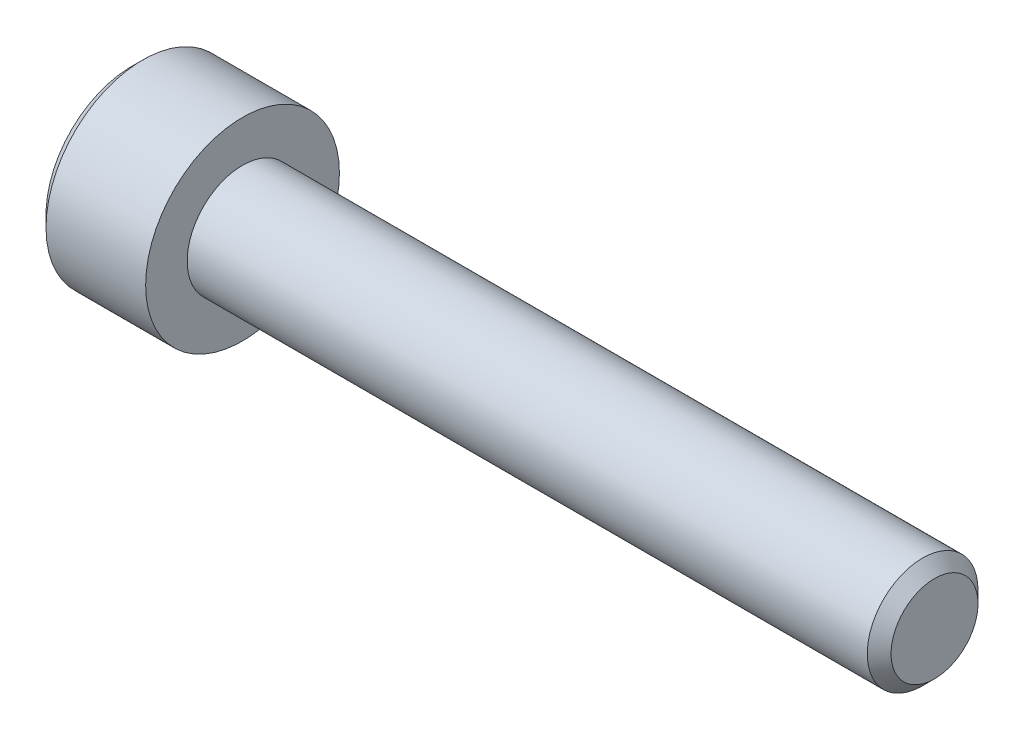
ISO-10303-21;
HEADER;
FILE_DESCRIPTION(('STEP AP214'),'2;1');
FILE_NAME('part.step','',(''),(''),'','','');
FILE_SCHEMA(('AUTOMOTIVE_DESIGN { 1 0 10303 214 1 1 1 1 }'));
ENDSEC;
DATA;
#1=APPLICATION_CONTEXT('core data for automotive mechanical design processes');
#2=APPLICATION_PROTOCOL_DEFINITION('international standard','automotive_design',2000,#1);
#3=PRODUCT_CONTEXT('',#1,'mechanical');
#4=PRODUCT('Part','Part','',(#3));
#5=PRODUCT_RELATED_PRODUCT_CATEGORY('part','',(#4));
#6=PRODUCT_DEFINITION_FORMATION('','',#4);
#7=PRODUCT_DEFINITION_CONTEXT('part definition',#1,'design');
#8=PRODUCT_DEFINITION('design','',#6,#7);
#9=PRODUCT_DEFINITION_SHAPE('','',#8);
#10=(LENGTH_UNIT() NAMED_UNIT(*) SI_UNIT(.MILLI.,.METRE.));
#11=(NAMED_UNIT(*) PLANE_ANGLE_UNIT() SI_UNIT($,.RADIAN.));
#12=(NAMED_UNIT(*) SI_UNIT($,.STERADIAN.) SOLID_ANGLE_UNIT());
#13=UNCERTAINTY_MEASURE_WITH_UNIT(LENGTH_MEASURE(1.E-05),#10,'distance_accuracy_value','');
#14=(GEOMETRIC_REPRESENTATION_CONTEXT(3) GLOBAL_UNCERTAINTY_ASSIGNED_CONTEXT((#13)) GLOBAL_UNIT_ASSIGNED_CONTEXT((#10,
#11,#12)) REPRESENTATION_CONTEXT('',''));
#15=CARTESIAN_POINT('',(0.,0.,0.));
#16=DIRECTION('',(0.,0.,1.));
#17=DIRECTION('',(1.,0.,0.));
#18=AXIS2_PLACEMENT_3D('',#15,#16,#17);
#19=CARTESIAN_POINT('',(-2.,0.,0.));
#20=DIRECTION('',(-1.,0.,0.));
#21=DIRECTION('',(0.,0.,1.));
#22=AXIS2_PLACEMENT_3D('',#19,#20,#21);
#23=CONICAL_SURFACE('',#22,1.5,1.30899693899575);
#24=CARTESIAN_POINT('',(-2.,0.,0.));
#25=DIRECTION('',(1.,0.,0.));
#26=DIRECTION('',(0.,0.,-1.));
#27=AXIS2_PLACEMENT_3D('',#24,#25,#26);
#28=CIRCLE('',#27,1.5);
#29=CARTESIAN_POINT('',(-2.,1.29903810567666,-0.75));
#30=VERTEX_POINT('',#29);
#31=CARTESIAN_POINT('',(-2.,1.29903810567666,0.75));
#32=VERTEX_POINT('',#31);
#33=EDGE_CURVE('E103',#30,#32,#28,.T.);
#34=ORIENTED_EDGE('',*,*,#33,.F.);
#35=CARTESIAN_POINT('',(-2.,0.,0.));
#36=DIRECTION('',(1.,0.,0.));
#37=DIRECTION('',(0.,0.,-1.));
#38=AXIS2_PLACEMENT_3D('',#35,#36,#37);
#39=CIRCLE('',#38,1.5);
#40=CARTESIAN_POINT('',(-2.,0.,-1.5));
#41=VERTEX_POINT('',#40);
#42=EDGE_CURVE('E106',#41,#30,#39,.T.);
#43=ORIENTED_EDGE('',*,*,#42,.F.);
#44=CARTESIAN_POINT('',(-2.,0.,0.));
#45=DIRECTION('',(1.,0.,0.));
#46=DIRECTION('',(0.,0.,-1.));
#47=AXIS2_PLACEMENT_3D('',#44,#45,#46);
#48=CIRCLE('',#47,1.5);
#49=CARTESIAN_POINT('',(-2.,-1.29903810567666,-0.75));
#50=VERTEX_POINT('',#49);
#51=EDGE_CURVE('E11',#50,#41,#48,.T.);
#52=ORIENTED_EDGE('',*,*,#51,.F.);
#53=CARTESIAN_POINT('',(-2.,0.,0.));
#54=DIRECTION('',(1.,0.,0.));
#55=DIRECTION('',(0.,0.,-1.));
#56=AXIS2_PLACEMENT_3D('',#53,#54,#55);
#57=CIRCLE('',#56,1.5);
#58=CARTESIAN_POINT('',(-2.,-1.29903810567666,0.75));
#59=VERTEX_POINT('',#58);
#60=EDGE_CURVE('E26',#59,#50,#57,.T.);
#61=ORIENTED_EDGE('',*,*,#60,.F.);
#62=CARTESIAN_POINT('',(-2.,0.,0.));
#63=DIRECTION('',(1.,0.,0.));
#64=DIRECTION('',(0.,0.,-1.));
#65=AXIS2_PLACEMENT_3D('',#62,#63,#64);
#66=CIRCLE('',#65,1.5);
#67=CARTESIAN_POINT('',(-2.,0.,1.5));
#68=VERTEX_POINT('',#67);
#69=EDGE_CURVE('E183',#68,#59,#66,.T.);
#70=ORIENTED_EDGE('',*,*,#69,.F.);
#71=CARTESIAN_POINT('',(-2.,0.,0.));
#72=DIRECTION('',(1.,0.,0.));
#73=DIRECTION('',(0.,0.,-1.));
#74=AXIS2_PLACEMENT_3D('',#71,#72,#73);
#75=CIRCLE('',#74,1.5);
#76=EDGE_CURVE('E39',#32,#68,#75,.T.);
#77=ORIENTED_EDGE('',*,*,#76,.F.);
#78=EDGE_LOOP('',(#34,#43,#52,#61,#70,#77));
#79=FACE_BOUND('',#78,.T.);
#80=CARTESIAN_POINT('',(-1.59807621135332,0.,0.));
#81=VERTEX_POINT('',#80);
#82=VERTEX_LOOP('',#81);
#83=FACE_BOUND('',#82,.T.);
#84=ADVANCED_FACE('F17',(#79,#83),#23,.F.);
#85=CARTESIAN_POINT('',(-2.,0.,0.));
#86=DIRECTION('',(1.,0.,0.));
#87=DIRECTION('',(0.,1.,0.));
#88=AXIS2_PLACEMENT_3D('',#85,#86,#87);
#89=PLANE('',#88);
#90=ORIENTED_EDGE('',*,*,#51,.T.);
#91=DIRECTION('',(0.,1.,0.));
#92=VECTOR('',#91,1.);
#93=CARTESIAN_POINT('',(-2.,-0.866025403784439,-1.5));
#94=LINE('',#93,#92);
#95=CARTESIAN_POINT('',(-2.,-0.866025403784439,-1.5));
#96=VERTEX_POINT('',#95);
#97=EDGE_CURVE('E172',#96,#41,#94,.T.);
#98=ORIENTED_EDGE('',*,*,#97,.F.);
#99=DIRECTION('',(0.,0.5,-0.866025403784439));
#100=VECTOR('',#99,1.);
#101=CARTESIAN_POINT('',(-2.,-1.73205080756888,0.));
#102=LINE('',#101,#100);
#103=EDGE_CURVE('E162',#50,#96,#102,.T.);
#104=ORIENTED_EDGE('',*,*,#103,.F.);
#105=EDGE_LOOP('',(#90,#98,#104));
#106=FACE_BOUND('',#105,.T.);
#107=ADVANCED_FACE('F198',(#106),#89,.F.);
#108=CARTESIAN_POINT('',(-2.,0.,0.));
#109=DIRECTION('',(1.,0.,0.));
#110=DIRECTION('',(0.,1.,0.));
#111=AXIS2_PLACEMENT_3D('',#108,#109,#110);
#112=PLANE('',#111);
#113=ORIENTED_EDGE('',*,*,#60,.T.);
#114=DIRECTION('',(0.,0.5,-0.866025403784439));
#115=VECTOR('',#114,1.);
#116=CARTESIAN_POINT('',(-2.,-1.73205080756888,0.));
#117=LINE('',#116,#115);
#118=CARTESIAN_POINT('',(-2.,-1.73205080756888,0.));
#119=VERTEX_POINT('',#118);
#120=EDGE_CURVE('E158',#119,#50,#117,.T.);
#121=ORIENTED_EDGE('',*,*,#120,.F.);
#122=DIRECTION('',(0.,-0.5,-0.866025403784439));
#123=VECTOR('',#122,1.);
#124=CARTESIAN_POINT('',(-2.,-0.866025403784439,1.5));
#125=LINE('',#124,#123);
#126=EDGE_CURVE('E150',#59,#119,#125,.T.);
#127=ORIENTED_EDGE('',*,*,#126,.F.);
#128=EDGE_LOOP('',(#113,#121,#127));
#129=FACE_BOUND('',#128,.T.);
#130=ADVANCED_FACE('F194',(#129),#112,.F.);
#131=CARTESIAN_POINT('',(-2.,0.,0.));
#132=DIRECTION('',(1.,0.,0.));
#133=DIRECTION('',(0.,1.,0.));
#134=AXIS2_PLACEMENT_3D('',#131,#132,#133);
#135=PLANE('',#134);
#136=ORIENTED_EDGE('',*,*,#69,.T.);
#137=DIRECTION('',(0.,-0.5,-0.866025403784439));
#138=VECTOR('',#137,1.);
#139=CARTESIAN_POINT('',(-2.,-0.866025403784439,1.5));
#140=LINE('',#139,#138);
#141=CARTESIAN_POINT('',(-2.,-0.866025403784439,1.5));
#142=VERTEX_POINT('',#141);
#143=EDGE_CURVE('E148',#142,#59,#140,.T.);
#144=ORIENTED_EDGE('',*,*,#143,.F.);
#145=DIRECTION('',(0.,-1.,0.));
#146=VECTOR('',#145,1.);
#147=CARTESIAN_POINT('',(-2.,0.866025403784439,1.5));
#148=LINE('',#147,#146);
#149=EDGE_CURVE('E220',#68,#142,#148,.T.);
#150=ORIENTED_EDGE('',*,*,#149,.F.);
#151=EDGE_LOOP('',(#136,#144,#150));
#152=FACE_BOUND('',#151,.T.);
#153=ADVANCED_FACE('F305',(#152),#135,.F.);
#154=CARTESIAN_POINT('',(-2.,0.,0.));
#155=DIRECTION('',(1.,0.,0.));
#156=DIRECTION('',(0.,1.,0.));
#157=AXIS2_PLACEMENT_3D('',#154,#155,#156);
#158=PLANE('',#157);
#159=ORIENTED_EDGE('',*,*,#76,.T.);
#160=DIRECTION('',(0.,-1.,0.));
#161=VECTOR('',#160,1.);
#162=CARTESIAN_POINT('',(-2.,0.866025403784439,1.5));
#163=LINE('',#162,#161);
#164=CARTESIAN_POINT('',(-2.,0.866025403784439,1.5));
#165=VERTEX_POINT('',#164);
#166=EDGE_CURVE('E226',#165,#68,#163,.T.);
#167=ORIENTED_EDGE('',*,*,#166,.F.);
#168=DIRECTION('',(0.,-0.5,0.866025403784439));
#169=VECTOR('',#168,1.);
#170=CARTESIAN_POINT('',(-2.,1.73205080756888,0.));
#171=LINE('',#170,#169);
#172=EDGE_CURVE('E122',#32,#165,#171,.T.);
#173=ORIENTED_EDGE('',*,*,#172,.F.);
#174=EDGE_LOOP('',(#159,#167,#173));
#175=FACE_BOUND('',#174,.T.);
#176=ADVANCED_FACE('F310',(#175),#158,.F.);
#177=CARTESIAN_POINT('',(-2.,0.,0.));
#178=DIRECTION('',(1.,0.,0.));
#179=DIRECTION('',(0.,1.,0.));
#180=AXIS2_PLACEMENT_3D('',#177,#178,#179);
#181=PLANE('',#180);
#182=DIRECTION('',(0.,0.5,0.866025403784439));
#183=VECTOR('',#182,1.);
#184=CARTESIAN_POINT('',(-2.,0.866025403784439,-1.5));
#185=LINE('',#184,#183);
#186=CARTESIAN_POINT('',(-2.,1.73205080756888,0.));
#187=VERTEX_POINT('',#186);
#188=EDGE_CURVE('E125',#30,#187,#185,.T.);
#189=ORIENTED_EDGE('',*,*,#188,.F.);
#190=ORIENTED_EDGE('',*,*,#33,.T.);
#191=DIRECTION('',(0.,-0.5,0.866025403784439));
#192=VECTOR('',#191,1.);
#193=CARTESIAN_POINT('',(-2.,1.73205080756888,0.));
#194=LINE('',#193,#192);
#195=EDGE_CURVE('E128',#187,#32,#194,.T.);
#196=ORIENTED_EDGE('',*,*,#195,.F.);
#197=EDGE_LOOP('',(#189,#190,#196));
#198=FACE_BOUND('',#197,.T.);
#199=ADVANCED_FACE('F126',(#198),#181,.F.);
#200=CARTESIAN_POINT('',(-2.,0.,0.));
#201=DIRECTION('',(1.,0.,0.));
#202=DIRECTION('',(0.,1.,0.));
#203=AXIS2_PLACEMENT_3D('',#200,#201,#202);
#204=PLANE('',#203);
#205=ORIENTED_EDGE('',*,*,#42,.T.);
#206=DIRECTION('',(0.,0.5,0.866025403784439));
#207=VECTOR('',#206,1.);
#208=CARTESIAN_POINT('',(-2.,0.866025403784439,-1.5));
#209=LINE('',#208,#207);
#210=CARTESIAN_POINT('',(-2.,0.866025403784438,-1.5));
#211=VERTEX_POINT('',#210);
#212=EDGE_CURVE('E116',#211,#30,#209,.T.);
#213=ORIENTED_EDGE('',*,*,#212,.F.);
#214=DIRECTION('',(0.,1.,0.));
#215=VECTOR('',#214,1.);
#216=CARTESIAN_POINT('',(-2.,-0.866025403784439,-1.5));
#217=LINE('',#216,#215);
#218=EDGE_CURVE('E119',#41,#211,#217,.T.);
#219=ORIENTED_EDGE('',*,*,#218,.F.);
#220=EDGE_LOOP('',(#205,#213,#219));
#221=FACE_BOUND('',#220,.T.);
#222=ADVANCED_FACE('F114',(#221),#204,.F.);
#223=CARTESIAN_POINT('',(-2.,1.73205080756888,0.));
#224=DIRECTION('',(0.,-0.866025403784439,-0.5));
#225=DIRECTION('',(0.,0.5,-0.866025403784439));
#226=AXIS2_PLACEMENT_3D('',#223,#224,#225);
#227=PLANE('',#226);
#228=DIRECTION('',(0.,-0.5,0.866025403784439));
#229=VECTOR('',#228,1.);
#230=CARTESIAN_POINT('',(-4.,1.73205080756888,0.));
#231=LINE('',#230,#229);
#232=CARTESIAN_POINT('',(-4.,1.73205080756888,0.));
#233=VERTEX_POINT('',#232);
#234=CARTESIAN_POINT('',(-4.,0.866025403784439,1.5));
#235=VERTEX_POINT('',#234);
#236=EDGE_CURVE('E252',#233,#235,#231,.T.);
#237=ORIENTED_EDGE('',*,*,#236,.F.);
#238=DIRECTION('',(-1.,0.,0.));
#239=VECTOR('',#238,1.);
#240=CARTESIAN_POINT('',(-2.,1.73205080756888,0.));
#241=LINE('',#240,#239);
#242=EDGE_CURVE('E133',#187,#233,#241,.T.);
#243=ORIENTED_EDGE('',*,*,#242,.F.);
#244=ORIENTED_EDGE('',*,*,#195,.T.);
#245=ORIENTED_EDGE('',*,*,#172,.T.);
#246=DIRECTION('',(-1.,0.,0.));
#247=VECTOR('',#246,1.);
#248=CARTESIAN_POINT('',(-2.,0.866025403784439,1.5));
#249=LINE('',#248,#247);
#250=EDGE_CURVE('E232',#165,#235,#249,.T.);
#251=ORIENTED_EDGE('',*,*,#250,.T.);
#252=EDGE_LOOP('',(#237,#243,#244,#245,#251));
#253=FACE_BOUND('',#252,.T.);
#254=ADVANCED_FACE('F315',(#253),#227,.T.);
#255=CARTESIAN_POINT('',(-2.,0.866025403784439,-1.5));
#256=DIRECTION('',(0.,-0.866025403784439,0.5));
#257=DIRECTION('',(-1.,0.,0.));
#258=AXIS2_PLACEMENT_3D('',#255,#256,#257);
#259=PLANE('',#258);
#260=DIRECTION('',(0.,0.5,0.866025403784439));
#261=VECTOR('',#260,1.);
#262=CARTESIAN_POINT('',(-4.,0.866025403784439,-1.5));
#263=LINE('',#262,#261);
#264=CARTESIAN_POINT('',(-4.,0.866025403784438,-1.5));
#265=VERTEX_POINT('',#264);
#266=EDGE_CURVE('E258',#265,#233,#263,.T.);
#267=ORIENTED_EDGE('',*,*,#266,.F.);
#268=DIRECTION('',(-1.,0.,0.));
#269=VECTOR('',#268,1.);
#270=CARTESIAN_POINT('',(-2.,0.866025403784438,-1.5));
#271=LINE('',#270,#269);
#272=EDGE_CURVE('E138',#211,#265,#271,.T.);
#273=ORIENTED_EDGE('',*,*,#272,.F.);
#274=ORIENTED_EDGE('',*,*,#212,.T.);
#275=ORIENTED_EDGE('',*,*,#188,.T.);
#276=ORIENTED_EDGE('',*,*,#242,.T.);
#277=EDGE_LOOP('',(#267,#273,#274,#275,#276));
#278=FACE_BOUND('',#277,.T.);
#279=ADVANCED_FACE('F136',(#278),#259,.T.);
#280=CARTESIAN_POINT('',(-2.,-0.866025403784439,-1.5));
#281=DIRECTION('',(0.,0.,1.));
#282=DIRECTION('',(1.,0.,0.));
#283=AXIS2_PLACEMENT_3D('',#280,#281,#282);
#284=PLANE('',#283);
#285=DIRECTION('',(0.,1.,0.));
#286=VECTOR('',#285,1.);
#287=CARTESIAN_POINT('',(-4.,-0.866025403784439,-1.5));
#288=LINE('',#287,#286);
#289=CARTESIAN_POINT('',(-4.,-0.866025403784439,-1.5));
#290=VERTEX_POINT('',#289);
#291=EDGE_CURVE('E262',#290,#265,#288,.T.);
#292=ORIENTED_EDGE('',*,*,#291,.F.);
#293=DIRECTION('',(-1.,0.,0.));
#294=VECTOR('',#293,1.);
#295=CARTESIAN_POINT('',(-2.,-0.866025403784439,-1.5));
#296=LINE('',#295,#294);
#297=EDGE_CURVE('E166',#96,#290,#296,.T.);
#298=ORIENTED_EDGE('',*,*,#297,.F.);
#299=ORIENTED_EDGE('',*,*,#97,.T.);
#300=ORIENTED_EDGE('',*,*,#218,.T.);
#301=ORIENTED_EDGE('',*,*,#272,.T.);
#302=EDGE_LOOP('',(#292,#298,#299,#300,#301));
#303=FACE_BOUND('',#302,.T.);
#304=ADVANCED_FACE('F321',(#303),#284,.T.);
#305=CARTESIAN_POINT('',(-2.,-1.73205080756888,0.));
#306=DIRECTION('',(0.,0.866025403784439,0.5));
#307=DIRECTION('',(1.,0.,0.));
#308=AXIS2_PLACEMENT_3D('',#305,#306,#307);
#309=PLANE('',#308);
#310=DIRECTION('',(0.,0.5,-0.866025403784439));
#311=VECTOR('',#310,1.);
#312=CARTESIAN_POINT('',(-4.,-1.73205080756888,0.));
#313=LINE('',#312,#311);
#314=CARTESIAN_POINT('',(-4.,-1.73205080756888,0.));
#315=VERTEX_POINT('',#314);
#316=EDGE_CURVE('E205',#315,#290,#313,.T.);
#317=ORIENTED_EDGE('',*,*,#316,.F.);
#318=DIRECTION('',(-1.,0.,0.));
#319=VECTOR('',#318,1.);
#320=CARTESIAN_POINT('',(-2.,-1.73205080756888,0.));
#321=LINE('',#320,#319);
#322=EDGE_CURVE('E153',#119,#315,#321,.T.);
#323=ORIENTED_EDGE('',*,*,#322,.F.);
#324=ORIENTED_EDGE('',*,*,#120,.T.);
#325=ORIENTED_EDGE('',*,*,#103,.T.);
#326=ORIENTED_EDGE('',*,*,#297,.T.);
#327=EDGE_LOOP('',(#317,#323,#324,#325,#326));
#328=FACE_BOUND('',#327,.T.);
#329=ADVANCED_FACE('F202',(#328),#309,.T.);
#330=CARTESIAN_POINT('',(-2.,-0.866025403784439,1.5));
#331=DIRECTION('',(0.,0.866025403784439,-0.5));
#332=DIRECTION('',(-1.,0.,0.));
#333=AXIS2_PLACEMENT_3D('',#330,#331,#332);
#334=PLANE('',#333);
#335=DIRECTION('',(0.,-0.5,-0.866025403784439));
#336=VECTOR('',#335,1.);
#337=CARTESIAN_POINT('',(-4.,-0.866025403784439,1.5));
#338=LINE('',#337,#336);
#339=CARTESIAN_POINT('',(-4.,-0.866025403784439,1.5));
#340=VERTEX_POINT('',#339);
#341=EDGE_CURVE('E245',#340,#315,#338,.T.);
#342=ORIENTED_EDGE('',*,*,#341,.F.);
#343=DIRECTION('',(-1.,0.,0.));
#344=VECTOR('',#343,1.);
#345=CARTESIAN_POINT('',(-2.,-0.866025403784439,1.5));
#346=LINE('',#345,#344);
#347=EDGE_CURVE('E211',#142,#340,#346,.T.);
#348=ORIENTED_EDGE('',*,*,#347,.F.);
#349=ORIENTED_EDGE('',*,*,#143,.T.);
#350=ORIENTED_EDGE('',*,*,#126,.T.);
#351=ORIENTED_EDGE('',*,*,#322,.T.);
#352=EDGE_LOOP('',(#342,#348,#349,#350,#351));
#353=FACE_BOUND('',#352,.T.);
#354=ADVANCED_FACE('F209',(#353),#334,.T.);
#355=CARTESIAN_POINT('',(-2.,0.866025403784439,1.5));
#356=DIRECTION('',(0.,0.,-1.));
#357=DIRECTION('',(0.,-1.,0.));
#358=AXIS2_PLACEMENT_3D('',#355,#356,#357);
#359=PLANE('',#358);
#360=DIRECTION('',(0.,-1.,0.));
#361=VECTOR('',#360,1.);
#362=CARTESIAN_POINT('',(-4.,0.866025403784439,1.5));
#363=LINE('',#362,#361);
#364=EDGE_CURVE('E248',#235,#340,#363,.T.);
#365=ORIENTED_EDGE('',*,*,#364,.F.);
#366=ORIENTED_EDGE('',*,*,#250,.F.);
#367=ORIENTED_EDGE('',*,*,#166,.T.);
#368=ORIENTED_EDGE('',*,*,#149,.T.);
#369=ORIENTED_EDGE('',*,*,#347,.T.);
#370=EDGE_LOOP('',(#365,#366,#367,#368,#369));
#371=FACE_BOUND('',#370,.T.);
#372=ADVANCED_FACE('F295',(#371),#359,.T.);
#373=CARTESIAN_POINT('',(25.,1.5705,0.));
#374=DIRECTION('',(-1.,0.,0.));
#375=DIRECTION('',(0.,0.,1.));
#376=AXIS2_PLACEMENT_3D('',#373,#374,#375);
#377=PLANE('',#376);
#378=CARTESIAN_POINT('',(25.,0.,0.));
#379=DIRECTION('',(1.,0.,0.));
#380=DIRECTION('',(0.,0.,-1.));
#381=AXIS2_PLACEMENT_3D('',#378,#379,#380);
#382=CIRCLE('',#381,1.5705);
#383=CARTESIAN_POINT('',(25.,0.,-1.5705));
#384=VERTEX_POINT('',#383);
#385=EDGE_CURVE('E235',#384,#384,#382,.T.);
#386=ORIENTED_EDGE('',*,*,#385,.T.);
#387=EDGE_LOOP('',(#386));
#388=FACE_BOUND('',#387,.T.);
#389=ADVANCED_FACE('F280',(#388),#377,.F.);
#390=CARTESIAN_POINT('',(24.5705,0.,0.));
#391=DIRECTION('',(-1.,0.,0.));
#392=DIRECTION('',(0.,0.,1.));
#393=AXIS2_PLACEMENT_3D('',#390,#391,#392);
#394=CONICAL_SURFACE('',#393,2.,0.785398163397445);
#395=CARTESIAN_POINT('',(24.5705,0.,0.));
#396=DIRECTION('',(1.,0.,0.));
#397=DIRECTION('',(0.,0.,-1.));
#398=AXIS2_PLACEMENT_3D('',#395,#396,#397);
#399=CIRCLE('',#398,2.);
#400=CARTESIAN_POINT('',(24.5705,0.,-2.));
#401=VERTEX_POINT('',#400);
#402=EDGE_CURVE('E238',#401,#401,#399,.T.);
#403=ORIENTED_EDGE('',*,*,#402,.T.);
#404=EDGE_LOOP('',(#403));
#405=FACE_BOUND('',#404,.T.);
#406=ORIENTED_EDGE('',*,*,#385,.F.);
#407=EDGE_LOOP('',(#406));
#408=FACE_BOUND('',#407,.T.);
#409=ADVANCED_FACE('F282',(#405,#408),#394,.T.);
#410=CARTESIAN_POINT('',(25.,0.,0.));
#411=DIRECTION('',(1.,0.,0.));
#412=DIRECTION('',(0.,0.,-1.));
#413=AXIS2_PLACEMENT_3D('',#410,#411,#412);
#414=CYLINDRICAL_SURFACE('',#413,2.);
#415=CARTESIAN_POINT('',(0.,0.,0.));
#416=DIRECTION('',(1.,0.,0.));
#417=DIRECTION('',(0.,0.,-1.));
#418=AXIS2_PLACEMENT_3D('',#415,#416,#417);
#419=CIRCLE('',#418,2.);
#420=CARTESIAN_POINT('',(0.,0.,-2.));
#421=VERTEX_POINT('',#420);
#422=EDGE_CURVE('E236',#421,#421,#419,.T.);
#423=ORIENTED_EDGE('',*,*,#422,.T.);
#424=EDGE_LOOP('',(#423));
#425=FACE_BOUND('',#424,.T.);
#426=ORIENTED_EDGE('',*,*,#402,.F.);
#427=EDGE_LOOP('',(#426));
#428=FACE_BOUND('',#427,.T.);
#429=ADVANCED_FACE('F284',(#425,#428),#414,.T.);
#430=CARTESIAN_POINT('',(0.,3.5,0.));
#431=DIRECTION('',(-1.,0.,0.));
#432=DIRECTION('',(0.,0.,1.));
#433=AXIS2_PLACEMENT_3D('',#430,#431,#432);
#434=PLANE('',#433);
#435=CARTESIAN_POINT('',(0.,0.,0.));
#436=DIRECTION('',(1.,0.,0.));
#437=DIRECTION('',(0.,0.,-1.));
#438=AXIS2_PLACEMENT_3D('',#435,#436,#437);
#439=CIRCLE('',#438,3.5);
#440=CARTESIAN_POINT('',(0.,0.,-3.5));
#441=VERTEX_POINT('',#440);
#442=EDGE_CURVE('E239',#441,#441,#439,.T.);
#443=ORIENTED_EDGE('',*,*,#442,.T.);
#444=EDGE_LOOP('',(#443));
#445=FACE_BOUND('',#444,.T.);
#446=ORIENTED_EDGE('',*,*,#422,.F.);
#447=EDGE_LOOP('',(#446));
#448=FACE_BOUND('',#447,.T.);
#449=ADVANCED_FACE('F292',(#445,#448),#434,.F.);
#450=CARTESIAN_POINT('',(25.,0.,0.));
#451=DIRECTION('',(1.,0.,0.));
#452=DIRECTION('',(0.,0.,-1.));
#453=AXIS2_PLACEMENT_3D('',#450,#451,#452);
#454=CYLINDRICAL_SURFACE('',#453,3.5);
#455=CARTESIAN_POINT('',(-3.6,0.,0.));
#456=DIRECTION('',(1.,0.,0.));
#457=DIRECTION('',(0.,0.,-1.));
#458=AXIS2_PLACEMENT_3D('',#455,#456,#457);
#459=CIRCLE('',#458,3.5);
#460=CARTESIAN_POINT('',(-3.6,0.,-3.5));
#461=VERTEX_POINT('',#460);
#462=EDGE_CURVE('E241',#461,#461,#459,.T.);
#463=ORIENTED_EDGE('',*,*,#462,.T.);
#464=EDGE_LOOP('',(#463));
#465=FACE_BOUND('',#464,.T.);
#466=ORIENTED_EDGE('',*,*,#442,.F.);
#467=EDGE_LOOP('',(#466));
#468=FACE_BOUND('',#467,.T.);
#469=ADVANCED_FACE('F337',(#465,#468),#454,.T.);
#470=CARTESIAN_POINT('',(-4.,0.,0.));
#471=DIRECTION('',(1.,0.,0.));
#472=DIRECTION('',(0.,0.,-1.));
#473=AXIS2_PLACEMENT_3D('',#470,#471,#472);
#474=CONICAL_SURFACE('',#473,3.1,0.785398163397447);
#475=CARTESIAN_POINT('',(-4.,0.,0.));
#476=DIRECTION('',(1.,0.,0.));
#477=DIRECTION('',(0.,0.,-1.));
#478=AXIS2_PLACEMENT_3D('',#475,#476,#477);
#479=CIRCLE('',#478,3.1);
#480=CARTESIAN_POINT('',(-4.,0.,-3.1));
#481=VERTEX_POINT('',#480);
#482=EDGE_CURVE('E268',#481,#481,#479,.T.);
#483=ORIENTED_EDGE('',*,*,#482,.T.);
#484=EDGE_LOOP('',(#483));
#485=FACE_BOUND('',#484,.T.);
#486=ORIENTED_EDGE('',*,*,#462,.F.);
#487=EDGE_LOOP('',(#486));
#488=FACE_BOUND('',#487,.T.);
#489=ADVANCED_FACE('F342',(#485,#488),#474,.T.);
#490=CARTESIAN_POINT('',(-4.,0.,0.));
#491=DIRECTION('',(1.,0.,0.));
#492=DIRECTION('',(0.,1.,0.));
#493=AXIS2_PLACEMENT_3D('',#490,#491,#492);
#494=PLANE('',#493);
#495=ORIENTED_EDGE('',*,*,#316,.T.);
#496=ORIENTED_EDGE('',*,*,#291,.T.);
#497=ORIENTED_EDGE('',*,*,#266,.T.);
#498=ORIENTED_EDGE('',*,*,#236,.T.);
#499=ORIENTED_EDGE('',*,*,#364,.T.);
#500=ORIENTED_EDGE('',*,*,#341,.T.);
#501=EDGE_LOOP('',(#495,#496,#497,#498,#499,#500));
#502=FACE_BOUND('',#501,.T.);
#503=ORIENTED_EDGE('',*,*,#482,.F.);
#504=EDGE_LOOP('',(#503));
#505=FACE_BOUND('',#504,.T.);
#506=ADVANCED_FACE('F339',(#502,#505),#494,.F.);
#507=CLOSED_SHELL('',(#84,#107,#130,#153,#176,#199,#222,#254,#279,#304,#329,#354,#372,#389,#409,
#429,#449,#469,#489,#506));
#508=MANIFOLD_SOLID_BREP('B1',#507);
#509=ADVANCED_BREP_SHAPE_REPRESENTATION('',(#18,#508),#14);
#510=SHAPE_DEFINITION_REPRESENTATION(#9,#509);
ENDSEC;
END-ISO-10303-21;
